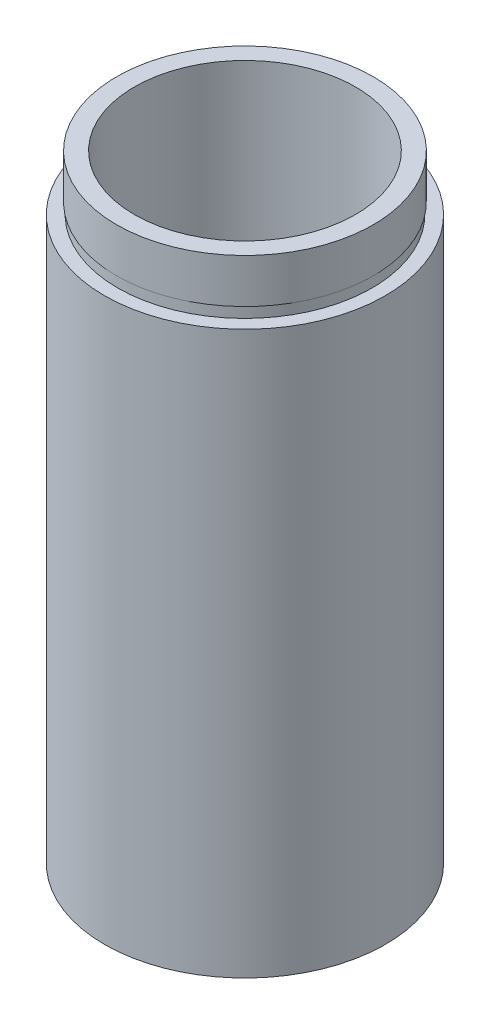
ISO-10303-21;
HEADER;
FILE_DESCRIPTION(('STEP AP214'),'2;1');
FILE_NAME('part.step','',(''),(''),'','','');
FILE_SCHEMA(('AUTOMOTIVE_DESIGN { 1 0 10303 214 1 1 1 1 }'));
ENDSEC;
DATA;
#1=APPLICATION_CONTEXT('core data for automotive mechanical design processes');
#2=APPLICATION_PROTOCOL_DEFINITION('international standard','automotive_design',2000,#1);
#3=PRODUCT_CONTEXT('',#1,'mechanical');
#4=PRODUCT('Part','Part','',(#3));
#5=PRODUCT_RELATED_PRODUCT_CATEGORY('part','',(#4));
#6=PRODUCT_DEFINITION_FORMATION('','',#4);
#7=PRODUCT_DEFINITION_CONTEXT('part definition',#1,'design');
#8=PRODUCT_DEFINITION('design','',#6,#7);
#9=PRODUCT_DEFINITION_SHAPE('','',#8);
#10=(LENGTH_UNIT() NAMED_UNIT(*) SI_UNIT(.MILLI.,.METRE.));
#11=(NAMED_UNIT(*) PLANE_ANGLE_UNIT() SI_UNIT($,.RADIAN.));
#12=(NAMED_UNIT(*) SI_UNIT($,.STERADIAN.) SOLID_ANGLE_UNIT());
#13=UNCERTAINTY_MEASURE_WITH_UNIT(LENGTH_MEASURE(1.E-05),#10,'distance_accuracy_value','');
#14=(GEOMETRIC_REPRESENTATION_CONTEXT(3) GLOBAL_UNCERTAINTY_ASSIGNED_CONTEXT((#13)) GLOBAL_UNIT_ASSIGNED_CONTEXT((#10,
#11,#12)) REPRESENTATION_CONTEXT('',''));
#15=CARTESIAN_POINT('',(0.,0.,0.));
#16=DIRECTION('',(0.,0.,1.));
#17=DIRECTION('',(1.,0.,0.));
#18=AXIS2_PLACEMENT_3D('',#15,#16,#17);
#19=CARTESIAN_POINT('',(11.1,0.,0.));
#20=DIRECTION('',(0.,1.,0.));
#21=DIRECTION('',(0.,0.,1.));
#22=AXIS2_PLACEMENT_3D('',#19,#20,#21);
#23=PLANE('',#22);
#24=CARTESIAN_POINT('',(0.,0.,0.));
#25=DIRECTION('',(0.,1.,0.));
#26=DIRECTION('',(0.,0.,1.));
#27=AXIS2_PLACEMENT_3D('',#24,#25,#26);
#28=CIRCLE('',#27,12.7);
#29=CARTESIAN_POINT('',(0.,0.,12.7));
#30=VERTEX_POINT('',#29);
#31=EDGE_CURVE('E10',#30,#30,#28,.T.);
#32=ORIENTED_EDGE('',*,*,#31,.F.);
#33=EDGE_LOOP('',(#32));
#34=FACE_BOUND('',#33,.T.);
#35=CARTESIAN_POINT('',(0.,0.,0.));
#36=DIRECTION('',(0.,1.,0.));
#37=DIRECTION('',(0.,0.,1.));
#38=AXIS2_PLACEMENT_3D('',#35,#36,#37);
#39=CIRCLE('',#38,11.1);
#40=CARTESIAN_POINT('',(0.,0.,11.1));
#41=VERTEX_POINT('',#40);
#42=EDGE_CURVE('E77',#41,#41,#39,.T.);
#43=ORIENTED_EDGE('',*,*,#42,.T.);
#44=EDGE_LOOP('',(#43));
#45=FACE_BOUND('',#44,.T.);
#46=ADVANCED_FACE('F37',(#34,#45),#23,.F.);
#47=CARTESIAN_POINT('',(0.,161.376166943427,0.));
#48=DIRECTION('',(0.,1.,0.));
#49=DIRECTION('',(0.,0.,1.));
#50=AXIS2_PLACEMENT_3D('',#47,#48,#49);
#51=CYLINDRICAL_SURFACE('',#50,12.7);
#52=CARTESIAN_POINT('',(0.,50.8,0.));
#53=DIRECTION('',(0.,1.,0.));
#54=DIRECTION('',(0.,0.,1.));
#55=AXIS2_PLACEMENT_3D('',#52,#53,#54);
#56=CIRCLE('',#55,12.7);
#57=CARTESIAN_POINT('',(0.,50.8,12.7));
#58=VERTEX_POINT('',#57);
#59=EDGE_CURVE('E43',#58,#58,#56,.T.);
#60=ORIENTED_EDGE('',*,*,#59,.F.);
#61=EDGE_LOOP('',(#60));
#62=FACE_BOUND('',#61,.T.);
#63=ORIENTED_EDGE('',*,*,#31,.T.);
#64=EDGE_LOOP('',(#63));
#65=FACE_BOUND('',#64,.T.);
#66=ADVANCED_FACE('F138',(#62,#65),#51,.T.);
#67=CARTESIAN_POINT('',(12.7,50.8,0.));
#68=DIRECTION('',(0.,-1.,0.));
#69=DIRECTION('',(0.,0.,-1.));
#70=AXIS2_PLACEMENT_3D('',#67,#68,#69);
#71=PLANE('',#70);
#72=CARTESIAN_POINT('',(0.,50.8,0.));
#73=DIRECTION('',(0.,1.,0.));
#74=DIRECTION('',(0.,0.,1.));
#75=AXIS2_PLACEMENT_3D('',#72,#73,#74);
#76=CIRCLE('',#75,11.5);
#77=CARTESIAN_POINT('',(0.,50.8,11.5));
#78=VERTEX_POINT('',#77);
#79=EDGE_CURVE('E47',#78,#78,#76,.T.);
#80=ORIENTED_EDGE('',*,*,#79,.F.);
#81=EDGE_LOOP('',(#80));
#82=FACE_BOUND('',#81,.T.);
#83=ORIENTED_EDGE('',*,*,#59,.T.);
#84=EDGE_LOOP('',(#83));
#85=FACE_BOUND('',#84,.T.);
#86=ADVANCED_FACE('F133',(#82,#85),#71,.F.);
#87=CARTESIAN_POINT('',(0.,161.376166943427,0.));
#88=DIRECTION('',(0.,1.,0.));
#89=DIRECTION('',(0.,0.,1.));
#90=AXIS2_PLACEMENT_3D('',#87,#88,#89);
#91=CYLINDRICAL_SURFACE('',#90,11.5);
#92=CARTESIAN_POINT('',(0.,51.8,0.));
#93=DIRECTION('',(0.,1.,0.));
#94=DIRECTION('',(0.,0.,1.));
#95=AXIS2_PLACEMENT_3D('',#92,#93,#94);
#96=CIRCLE('',#95,11.5);
#97=CARTESIAN_POINT('',(0.,51.8,11.5));
#98=VERTEX_POINT('',#97);
#99=EDGE_CURVE('E51',#98,#98,#96,.T.);
#100=ORIENTED_EDGE('',*,*,#99,.F.);
#101=EDGE_LOOP('',(#100));
#102=FACE_BOUND('',#101,.T.);
#103=ORIENTED_EDGE('',*,*,#79,.T.);
#104=EDGE_LOOP('',(#103));
#105=FACE_BOUND('',#104,.T.);
#106=ADVANCED_FACE('F127',(#102,#105),#91,.T.);
#107=CARTESIAN_POINT('',(11.5,51.8,0.));
#108=DIRECTION('',(0.,1.,0.));
#109=DIRECTION('',(0.,0.,1.));
#110=AXIS2_PLACEMENT_3D('',#107,#108,#109);
#111=PLANE('',#110);
#112=CARTESIAN_POINT('',(0.,51.8,0.));
#113=DIRECTION('',(0.,1.,0.));
#114=DIRECTION('',(0.,0.,1.));
#115=AXIS2_PLACEMENT_3D('',#112,#113,#114);
#116=CIRCLE('',#115,11.6);
#117=CARTESIAN_POINT('',(0.,51.8,11.6));
#118=VERTEX_POINT('',#117);
#119=EDGE_CURVE('E56',#118,#118,#116,.T.);
#120=ORIENTED_EDGE('',*,*,#119,.F.);
#121=EDGE_LOOP('',(#120));
#122=FACE_BOUND('',#121,.T.);
#123=ORIENTED_EDGE('',*,*,#99,.T.);
#124=EDGE_LOOP('',(#123));
#125=FACE_BOUND('',#124,.T.);
#126=ADVANCED_FACE('F121',(#122,#125),#111,.F.);
#127=CARTESIAN_POINT('',(0.,161.376166943427,0.));
#128=DIRECTION('',(0.,1.,0.));
#129=DIRECTION('',(0.,0.,1.));
#130=AXIS2_PLACEMENT_3D('',#127,#128,#129);
#131=CYLINDRICAL_SURFACE('',#130,11.6);
#132=CARTESIAN_POINT('',(0.,55.8,0.));
#133=DIRECTION('',(0.,1.,0.));
#134=DIRECTION('',(0.,0.,1.));
#135=AXIS2_PLACEMENT_3D('',#132,#133,#134);
#136=CIRCLE('',#135,11.6);
#137=CARTESIAN_POINT('',(0.,55.8,11.6));
#138=VERTEX_POINT('',#137);
#139=EDGE_CURVE('E59',#138,#138,#136,.T.);
#140=ORIENTED_EDGE('',*,*,#139,.F.);
#141=EDGE_LOOP('',(#140));
#142=FACE_BOUND('',#141,.T.);
#143=ORIENTED_EDGE('',*,*,#119,.T.);
#144=EDGE_LOOP('',(#143));
#145=FACE_BOUND('',#144,.T.);
#146=ADVANCED_FACE('F115',(#142,#145),#131,.T.);
#147=CARTESIAN_POINT('',(11.6,55.8,0.));
#148=DIRECTION('',(0.,-1.,0.));
#149=DIRECTION('',(0.,0.,-1.));
#150=AXIS2_PLACEMENT_3D('',#147,#148,#149);
#151=PLANE('',#150);
#152=CARTESIAN_POINT('',(0.,55.8,0.));
#153=DIRECTION('',(0.,1.,0.));
#154=DIRECTION('',(0.,0.,1.));
#155=AXIS2_PLACEMENT_3D('',#152,#153,#154);
#156=CIRCLE('',#155,10.);
#157=CARTESIAN_POINT('',(0.,55.8,10.));
#158=VERTEX_POINT('',#157);
#159=EDGE_CURVE('E62',#158,#158,#156,.T.);
#160=ORIENTED_EDGE('',*,*,#159,.F.);
#161=EDGE_LOOP('',(#160));
#162=FACE_BOUND('',#161,.T.);
#163=ORIENTED_EDGE('',*,*,#139,.T.);
#164=EDGE_LOOP('',(#163));
#165=FACE_BOUND('',#164,.T.);
#166=ADVANCED_FACE('F109',(#162,#165),#151,.F.);
#167=CARTESIAN_POINT('',(0.,161.376166943427,0.));
#168=DIRECTION('',(0.,1.,0.));
#169=DIRECTION('',(0.,0.,1.));
#170=AXIS2_PLACEMENT_3D('',#167,#168,#169);
#171=CYLINDRICAL_SURFACE('',#170,10.);
#172=CARTESIAN_POINT('',(0.,5.49999999999998,0.));
#173=DIRECTION('',(0.,1.,0.));
#174=DIRECTION('',(0.,0.,1.));
#175=AXIS2_PLACEMENT_3D('',#172,#173,#174);
#176=CIRCLE('',#175,10.);
#177=CARTESIAN_POINT('',(0.,5.49999999999998,10.));
#178=VERTEX_POINT('',#177);
#179=EDGE_CURVE('E65',#178,#178,#176,.T.);
#180=ORIENTED_EDGE('',*,*,#179,.F.);
#181=EDGE_LOOP('',(#180));
#182=FACE_BOUND('',#181,.T.);
#183=ORIENTED_EDGE('',*,*,#159,.T.);
#184=EDGE_LOOP('',(#183));
#185=FACE_BOUND('',#184,.T.);
#186=ADVANCED_FACE('F103',(#182,#185),#171,.F.);
#187=CARTESIAN_POINT('',(11.7,5.49999999999998,0.));
#188=DIRECTION('',(0.,1.,0.));
#189=DIRECTION('',(0.,0.,1.));
#190=AXIS2_PLACEMENT_3D('',#187,#188,#189);
#191=PLANE('',#190);
#192=CARTESIAN_POINT('',(0.,5.49999999999998,0.));
#193=DIRECTION('',(0.,1.,0.));
#194=DIRECTION('',(0.,0.,1.));
#195=AXIS2_PLACEMENT_3D('',#192,#193,#194);
#196=CIRCLE('',#195,11.7);
#197=CARTESIAN_POINT('',(0.,5.49999999999998,11.7));
#198=VERTEX_POINT('',#197);
#199=EDGE_CURVE('E68',#198,#198,#196,.T.);
#200=ORIENTED_EDGE('',*,*,#199,.F.);
#201=EDGE_LOOP('',(#200));
#202=FACE_BOUND('',#201,.T.);
#203=ORIENTED_EDGE('',*,*,#179,.T.);
#204=EDGE_LOOP('',(#203));
#205=FACE_BOUND('',#204,.T.);
#206=ADVANCED_FACE('F97',(#202,#205),#191,.F.);
#207=CARTESIAN_POINT('',(0.,161.376166943427,0.));
#208=DIRECTION('',(0.,1.,0.));
#209=DIRECTION('',(0.,0.,1.));
#210=AXIS2_PLACEMENT_3D('',#207,#208,#209);
#211=CYLINDRICAL_SURFACE('',#210,11.7);
#212=CARTESIAN_POINT('',(0.,4.49999999999998,0.));
#213=DIRECTION('',(0.,1.,0.));
#214=DIRECTION('',(0.,0.,1.));
#215=AXIS2_PLACEMENT_3D('',#212,#213,#214);
#216=CIRCLE('',#215,11.7);
#217=CARTESIAN_POINT('',(0.,4.49999999999998,11.7));
#218=VERTEX_POINT('',#217);
#219=EDGE_CURVE('E71',#218,#218,#216,.T.);
#220=ORIENTED_EDGE('',*,*,#219,.F.);
#221=EDGE_LOOP('',(#220));
#222=FACE_BOUND('',#221,.T.);
#223=ORIENTED_EDGE('',*,*,#199,.T.);
#224=EDGE_LOOP('',(#223));
#225=FACE_BOUND('',#224,.T.);
#226=ADVANCED_FACE('F91',(#222,#225),#211,.F.);
#227=CARTESIAN_POINT('',(11.1,4.49999999999998,0.));
#228=DIRECTION('',(0.,-1.,0.));
#229=DIRECTION('',(0.,0.,-1.));
#230=AXIS2_PLACEMENT_3D('',#227,#228,#229);
#231=PLANE('',#230);
#232=CARTESIAN_POINT('',(0.,4.49999999999998,0.));
#233=DIRECTION('',(0.,1.,0.));
#234=DIRECTION('',(0.,0.,1.));
#235=AXIS2_PLACEMENT_3D('',#232,#233,#234);
#236=CIRCLE('',#235,11.1);
#237=CARTESIAN_POINT('',(0.,4.49999999999998,11.1));
#238=VERTEX_POINT('',#237);
#239=EDGE_CURVE('E74',#238,#238,#236,.T.);
#240=ORIENTED_EDGE('',*,*,#239,.F.);
#241=EDGE_LOOP('',(#240));
#242=FACE_BOUND('',#241,.T.);
#243=ORIENTED_EDGE('',*,*,#219,.T.);
#244=EDGE_LOOP('',(#243));
#245=FACE_BOUND('',#244,.T.);
#246=ADVANCED_FACE('F85',(#242,#245),#231,.F.);
#247=CARTESIAN_POINT('',(0.,161.376166943427,0.));
#248=DIRECTION('',(0.,1.,0.));
#249=DIRECTION('',(0.,0.,1.));
#250=AXIS2_PLACEMENT_3D('',#247,#248,#249);
#251=CYLINDRICAL_SURFACE('',#250,11.1);
#252=ORIENTED_EDGE('',*,*,#42,.F.);
#253=EDGE_LOOP('',(#252));
#254=FACE_BOUND('',#253,.T.);
#255=ORIENTED_EDGE('',*,*,#239,.T.);
#256=EDGE_LOOP('',(#255));
#257=FACE_BOUND('',#256,.T.);
#258=ADVANCED_FACE('F82',(#254,#257),#251,.F.);
#259=CLOSED_SHELL('',(#46,#66,#86,#106,#126,#146,#166,#186,#206,#226,#246,#258));
#260=MANIFOLD_SOLID_BREP('B2',#259);
#261=ADVANCED_BREP_SHAPE_REPRESENTATION('',(#18,#260),#14);
#262=SHAPE_DEFINITION_REPRESENTATION(#9,#261);
ENDSEC;
END-ISO-10303-21;
